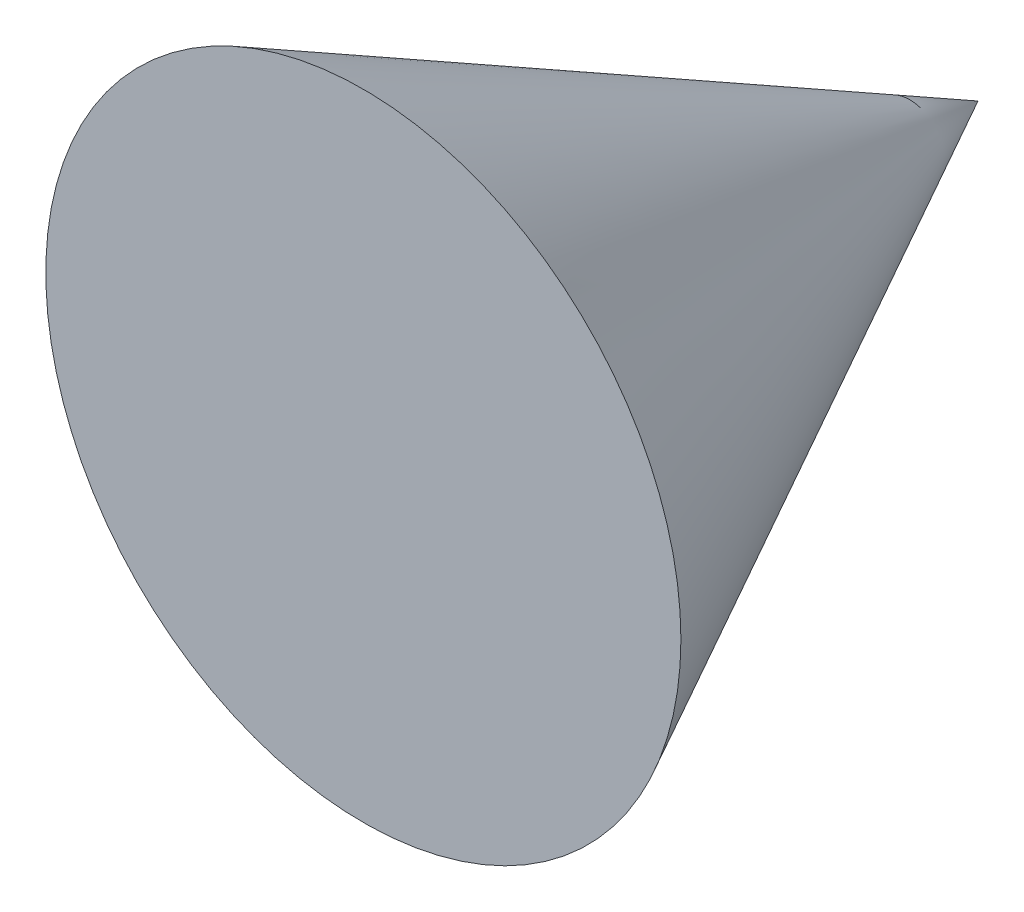
ISO-10303-21;
HEADER;
FILE_DESCRIPTION(('STEP AP214'),'2;1');
FILE_NAME('part.step','',(''),(''),'','','');
FILE_SCHEMA(('AUTOMOTIVE_DESIGN { 1 0 10303 214 1 1 1 1 }'));
ENDSEC;
DATA;
#1=APPLICATION_CONTEXT('core data for automotive mechanical design processes');
#2=APPLICATION_PROTOCOL_DEFINITION('international standard','automotive_design',2000,#1);
#3=PRODUCT_CONTEXT('',#1,'mechanical');
#4=PRODUCT('Part','Part','',(#3));
#5=PRODUCT_RELATED_PRODUCT_CATEGORY('part','',(#4));
#6=PRODUCT_DEFINITION_FORMATION('','',#4);
#7=PRODUCT_DEFINITION_CONTEXT('part definition',#1,'design');
#8=PRODUCT_DEFINITION('design','',#6,#7);
#9=PRODUCT_DEFINITION_SHAPE('','',#8);
#10=(LENGTH_UNIT() NAMED_UNIT(*) SI_UNIT(.MILLI.,.METRE.));
#11=(NAMED_UNIT(*) PLANE_ANGLE_UNIT() SI_UNIT($,.RADIAN.));
#12=(NAMED_UNIT(*) SI_UNIT($,.STERADIAN.) SOLID_ANGLE_UNIT());
#13=UNCERTAINTY_MEASURE_WITH_UNIT(LENGTH_MEASURE(1.E-05),#10,'distance_accuracy_value','');
#14=(GEOMETRIC_REPRESENTATION_CONTEXT(3) GLOBAL_UNCERTAINTY_ASSIGNED_CONTEXT((#13)) GLOBAL_UNIT_ASSIGNED_CONTEXT((#10,
#11,#12)) REPRESENTATION_CONTEXT('',''));
#15=CARTESIAN_POINT('',(0.,0.,0.));
#16=DIRECTION('',(0.,0.,1.));
#17=DIRECTION('',(1.,0.,0.));
#18=AXIS2_PLACEMENT_3D('',#15,#16,#17);
#19=CARTESIAN_POINT('',(155.,0.,0.));
#20=DIRECTION('',(0.,0.,1.));
#21=DIRECTION('',(1.,0.,0.));
#22=AXIS2_PLACEMENT_3D('',#19,#20,#21);
#23=PLANE('',#22);
#24=CARTESIAN_POINT('',(0.,0.,0.));
#25=DIRECTION('',(0.,0.,1.));
#26=DIRECTION('',(1.,0.,0.));
#27=AXIS2_PLACEMENT_3D('',#24,#25,#26);
#28=CIRCLE('',#27,155.);
#29=CARTESIAN_POINT('',(155.,0.,0.));
#30=VERTEX_POINT('',#29);
#31=EDGE_CURVE('E11',#30,#30,#28,.T.);
#32=ORIENTED_EDGE('',*,*,#31,.T.);
#33=EDGE_LOOP('',(#32));
#34=FACE_BOUND('',#33,.T.);
#35=ADVANCED_FACE('F33',(#34),#23,.T.);
#36=CARTESIAN_POINT('',(0.,0.,0.));
#37=DIRECTION('',(0.,0.,1.));
#38=DIRECTION('',(1.,0.,0.));
#39=AXIS2_PLACEMENT_3D('',#36,#37,#38);
#40=CONICAL_SURFACE('',#39,155.,0.476891867665535);
#41=CARTESIAN_POINT('',(0.,0.,-300.));
#42=VERTEX_POINT('',#41);
#43=VERTEX_LOOP('',#42);
#44=FACE_BOUND('',#43,.T.);
#45=ORIENTED_EDGE('',*,*,#31,.F.);
#46=EDGE_LOOP('',(#45));
#47=FACE_BOUND('',#46,.T.);
#48=ADVANCED_FACE('F40',(#44,#47),#40,.T.);
#49=CLOSED_SHELL('',(#35,#48));
#50=MANIFOLD_SOLID_BREP('B2',#49);
#51=ADVANCED_BREP_SHAPE_REPRESENTATION('',(#18,#50),#14);
#52=SHAPE_DEFINITION_REPRESENTATION(#9,#51);
ENDSEC;
END-ISO-10303-21;
